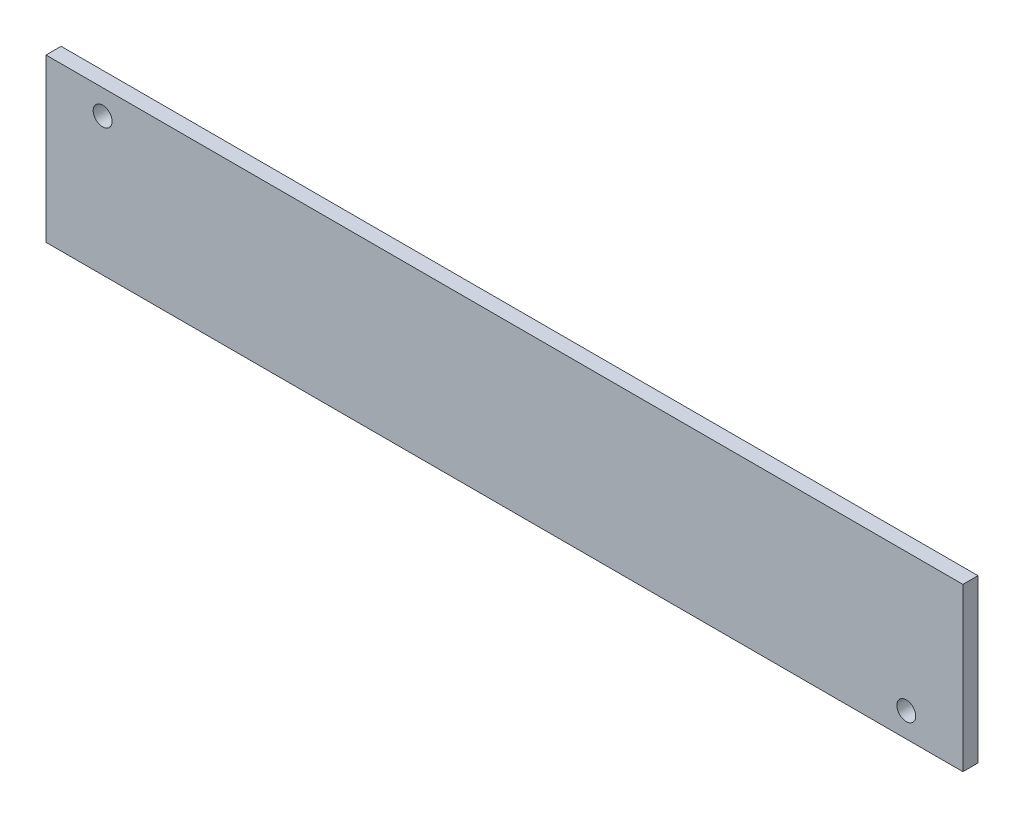
ISO-10303-21;
HEADER;
FILE_DESCRIPTION(('STEP AP214'),'2;1');
FILE_NAME('part.step','',(''),(''),'','','');
FILE_SCHEMA(('AUTOMOTIVE_DESIGN { 1 0 10303 214 1 1 1 1 }'));
ENDSEC;
DATA;
#1=APPLICATION_CONTEXT('core data for automotive mechanical design processes');
#2=APPLICATION_PROTOCOL_DEFINITION('international standard','automotive_design',2000,#1);
#3=PRODUCT_CONTEXT('',#1,'mechanical');
#4=PRODUCT('Part','Part','',(#3));
#5=PRODUCT_RELATED_PRODUCT_CATEGORY('part','',(#4));
#6=PRODUCT_DEFINITION_FORMATION('','',#4);
#7=PRODUCT_DEFINITION_CONTEXT('part definition',#1,'design');
#8=PRODUCT_DEFINITION('design','',#6,#7);
#9=PRODUCT_DEFINITION_SHAPE('','',#8);
#10=(LENGTH_UNIT() NAMED_UNIT(*) SI_UNIT(.MILLI.,.METRE.));
#11=(NAMED_UNIT(*) PLANE_ANGLE_UNIT() SI_UNIT($,.RADIAN.));
#12=(NAMED_UNIT(*) SI_UNIT($,.STERADIAN.) SOLID_ANGLE_UNIT());
#13=UNCERTAINTY_MEASURE_WITH_UNIT(LENGTH_MEASURE(1.E-05),#10,'distance_accuracy_value','');
#14=(GEOMETRIC_REPRESENTATION_CONTEXT(3) GLOBAL_UNCERTAINTY_ASSIGNED_CONTEXT((#13)) GLOBAL_UNIT_ASSIGNED_CONTEXT((#10,
#11,#12)) REPRESENTATION_CONTEXT('',''));
#15=CARTESIAN_POINT('',(0.,0.,0.));
#16=DIRECTION('',(0.,0.,1.));
#17=DIRECTION('',(1.,0.,0.));
#18=AXIS2_PLACEMENT_3D('',#15,#16,#17);
#19=CARTESIAN_POINT('',(-60.75,10.75,2.));
#20=DIRECTION('',(1.,0.,0.));
#21=DIRECTION('',(0.,0.,-1.));
#22=AXIS2_PLACEMENT_3D('',#19,#20,#21);
#23=PLANE('',#22);
#24=DIRECTION('',(0.,-1.,0.));
#25=VECTOR('',#24,1.);
#26=CARTESIAN_POINT('',(-60.75,10.75,0.));
#27=LINE('',#26,#25);
#28=CARTESIAN_POINT('',(-60.75,10.75,0.));
#29=VERTEX_POINT('',#28);
#30=CARTESIAN_POINT('',(-60.75,-10.75,0.));
#31=VERTEX_POINT('',#30);
#32=EDGE_CURVE('E102',#29,#31,#27,.T.);
#33=ORIENTED_EDGE('',*,*,#32,.T.);
#34=DIRECTION('',(0.,0.,-1.));
#35=VECTOR('',#34,1.);
#36=CARTESIAN_POINT('',(-60.75,-10.75,2.));
#37=LINE('',#36,#35);
#38=CARTESIAN_POINT('',(-60.75,-10.75,2.));
#39=VERTEX_POINT('',#38);
#40=EDGE_CURVE('E11',#39,#31,#37,.T.);
#41=ORIENTED_EDGE('',*,*,#40,.F.);
#42=DIRECTION('',(0.,-1.,0.));
#43=VECTOR('',#42,1.);
#44=CARTESIAN_POINT('',(-60.75,10.75,2.));
#45=LINE('',#44,#43);
#46=CARTESIAN_POINT('',(-60.75,10.75,2.));
#47=VERTEX_POINT('',#46);
#48=EDGE_CURVE('E90',#47,#39,#45,.T.);
#49=ORIENTED_EDGE('',*,*,#48,.F.);
#50=DIRECTION('',(0.,0.,-1.));
#51=VECTOR('',#50,1.);
#52=CARTESIAN_POINT('',(-60.75,10.75,2.));
#53=LINE('',#52,#51);
#54=EDGE_CURVE('E98',#47,#29,#53,.T.);
#55=ORIENTED_EDGE('',*,*,#54,.T.);
#56=EDGE_LOOP('',(#33,#41,#49,#55));
#57=FACE_BOUND('',#56,.T.);
#58=ADVANCED_FACE('F39',(#57),#23,.F.);
#59=CARTESIAN_POINT('',(-60.75,-10.75,2.));
#60=DIRECTION('',(0.,1.,0.));
#61=DIRECTION('',(0.,0.,1.));
#62=AXIS2_PLACEMENT_3D('',#59,#60,#61);
#63=PLANE('',#62);
#64=DIRECTION('',(1.,0.,0.));
#65=VECTOR('',#64,1.);
#66=CARTESIAN_POINT('',(-60.75,-10.75,0.));
#67=LINE('',#66,#65);
#68=CARTESIAN_POINT('',(60.75,-10.75,0.));
#69=VERTEX_POINT('',#68);
#70=EDGE_CURVE('E94',#31,#69,#67,.T.);
#71=ORIENTED_EDGE('',*,*,#70,.T.);
#72=DIRECTION('',(0.,0.,-1.));
#73=VECTOR('',#72,1.);
#74=CARTESIAN_POINT('',(60.75,-10.75,2.));
#75=LINE('',#74,#73);
#76=CARTESIAN_POINT('',(60.75,-10.75,2.));
#77=VERTEX_POINT('',#76);
#78=EDGE_CURVE('E47',#77,#69,#75,.T.);
#79=ORIENTED_EDGE('',*,*,#78,.F.);
#80=DIRECTION('',(1.,0.,0.));
#81=VECTOR('',#80,1.);
#82=CARTESIAN_POINT('',(-60.75,-10.75,2.));
#83=LINE('',#82,#81);
#84=EDGE_CURVE('E85',#39,#77,#83,.T.);
#85=ORIENTED_EDGE('',*,*,#84,.F.);
#86=ORIENTED_EDGE('',*,*,#40,.T.);
#87=EDGE_LOOP('',(#71,#79,#85,#86));
#88=FACE_BOUND('',#87,.T.);
#89=ADVANCED_FACE('F93',(#88),#63,.F.);
#90=CARTESIAN_POINT('',(60.75,10.75,2.));
#91=DIRECTION('',(-1.,0.,0.));
#92=DIRECTION('',(0.,-1.,0.));
#93=AXIS2_PLACEMENT_3D('',#90,#91,#92);
#94=PLANE('',#93);
#95=DIRECTION('',(0.,1.,0.));
#96=VECTOR('',#95,1.);
#97=CARTESIAN_POINT('',(60.75,10.75,0.));
#98=LINE('',#97,#96);
#99=CARTESIAN_POINT('',(60.75,10.75,0.));
#100=VERTEX_POINT('',#99);
#101=EDGE_CURVE('E72',#69,#100,#98,.T.);
#102=ORIENTED_EDGE('',*,*,#101,.T.);
#103=DIRECTION('',(0.,0.,-1.));
#104=VECTOR('',#103,1.);
#105=CARTESIAN_POINT('',(60.75,10.75,2.));
#106=LINE('',#105,#104);
#107=CARTESIAN_POINT('',(60.75,10.75,2.));
#108=VERTEX_POINT('',#107);
#109=EDGE_CURVE('E95',#108,#100,#106,.T.);
#110=ORIENTED_EDGE('',*,*,#109,.F.);
#111=DIRECTION('',(0.,1.,0.));
#112=VECTOR('',#111,1.);
#113=CARTESIAN_POINT('',(60.75,10.75,2.));
#114=LINE('',#113,#112);
#115=EDGE_CURVE('E88',#77,#108,#114,.T.);
#116=ORIENTED_EDGE('',*,*,#115,.F.);
#117=ORIENTED_EDGE('',*,*,#78,.T.);
#118=EDGE_LOOP('',(#102,#110,#116,#117));
#119=FACE_BOUND('',#118,.T.);
#120=ADVANCED_FACE('F96',(#119),#94,.F.);
#121=CARTESIAN_POINT('',(-60.75,10.75,2.));
#122=DIRECTION('',(0.,-1.,0.));
#123=DIRECTION('',(0.,0.,-1.));
#124=AXIS2_PLACEMENT_3D('',#121,#122,#123);
#125=PLANE('',#124);
#126=DIRECTION('',(-1.,0.,0.));
#127=VECTOR('',#126,1.);
#128=CARTESIAN_POINT('',(-60.75,10.75,0.));
#129=LINE('',#128,#127);
#130=EDGE_CURVE('E78',#100,#29,#129,.T.);
#131=ORIENTED_EDGE('',*,*,#130,.T.);
#132=ORIENTED_EDGE('',*,*,#54,.F.);
#133=DIRECTION('',(-1.,0.,0.));
#134=VECTOR('',#133,1.);
#135=CARTESIAN_POINT('',(-60.75,10.75,2.));
#136=LINE('',#135,#134);
#137=EDGE_CURVE('E55',#108,#47,#136,.T.);
#138=ORIENTED_EDGE('',*,*,#137,.F.);
#139=ORIENTED_EDGE('',*,*,#109,.T.);
#140=EDGE_LOOP('',(#131,#132,#138,#139));
#141=FACE_BOUND('',#140,.T.);
#142=ADVANCED_FACE('F110',(#141),#125,.F.);
#143=CARTESIAN_POINT('',(0.,0.,2.));
#144=DIRECTION('',(0.,0.,1.));
#145=DIRECTION('',(1.,0.,0.));
#146=AXIS2_PLACEMENT_3D('',#143,#144,#145);
#147=PLANE('',#146);
#148=CARTESIAN_POINT('',(-53.25,7.5,2.));
#149=DIRECTION('',(0.,0.,1.));
#150=DIRECTION('',(1.,0.,0.));
#151=AXIS2_PLACEMENT_3D('',#148,#149,#150);
#152=CIRCLE('',#151,1.25);
#153=CARTESIAN_POINT('',(-52.,7.5,2.));
#154=VERTEX_POINT('',#153);
#155=EDGE_CURVE('E122',#154,#154,#152,.T.);
#156=ORIENTED_EDGE('',*,*,#155,.F.);
#157=EDGE_LOOP('',(#156));
#158=FACE_BOUND('',#157,.T.);
#159=CARTESIAN_POINT('',(53.25,-7.5,2.));
#160=DIRECTION('',(0.,0.,1.));
#161=DIRECTION('',(1.,0.,0.));
#162=AXIS2_PLACEMENT_3D('',#159,#160,#161);
#163=CIRCLE('',#162,1.25);
#164=CARTESIAN_POINT('',(54.5,-7.5,2.));
#165=VERTEX_POINT('',#164);
#166=EDGE_CURVE('E119',#165,#165,#163,.T.);
#167=ORIENTED_EDGE('',*,*,#166,.F.);
#168=EDGE_LOOP('',(#167));
#169=FACE_BOUND('',#168,.T.);
#170=ORIENTED_EDGE('',*,*,#48,.T.);
#171=ORIENTED_EDGE('',*,*,#84,.T.);
#172=ORIENTED_EDGE('',*,*,#115,.T.);
#173=ORIENTED_EDGE('',*,*,#137,.T.);
#174=EDGE_LOOP('',(#170,#171,#172,#173));
#175=FACE_BOUND('',#174,.T.);
#176=ADVANCED_FACE('F86',(#158,#169,#175),#147,.T.);
#177=CARTESIAN_POINT('',(0.,0.,0.));
#178=DIRECTION('',(0.,0.,1.));
#179=DIRECTION('',(1.,0.,0.));
#180=AXIS2_PLACEMENT_3D('',#177,#178,#179);
#181=PLANE('',#180);
#182=CARTESIAN_POINT('',(-53.25,7.5,0.));
#183=DIRECTION('',(0.,0.,1.));
#184=DIRECTION('',(1.,0.,0.));
#185=AXIS2_PLACEMENT_3D('',#182,#183,#184);
#186=CIRCLE('',#185,1.25);
#187=CARTESIAN_POINT('',(-52.,7.5,0.));
#188=VERTEX_POINT('',#187);
#189=EDGE_CURVE('E105',#188,#188,#186,.T.);
#190=ORIENTED_EDGE('',*,*,#189,.T.);
#191=EDGE_LOOP('',(#190));
#192=FACE_BOUND('',#191,.T.);
#193=CARTESIAN_POINT('',(53.25,-7.5,0.));
#194=DIRECTION('',(0.,0.,1.));
#195=DIRECTION('',(1.,0.,0.));
#196=AXIS2_PLACEMENT_3D('',#193,#194,#195);
#197=CIRCLE('',#196,1.25);
#198=CARTESIAN_POINT('',(54.5,-7.5,0.));
#199=VERTEX_POINT('',#198);
#200=EDGE_CURVE('E116',#199,#199,#197,.T.);
#201=ORIENTED_EDGE('',*,*,#200,.T.);
#202=EDGE_LOOP('',(#201));
#203=FACE_BOUND('',#202,.T.);
#204=ORIENTED_EDGE('',*,*,#32,.F.);
#205=ORIENTED_EDGE('',*,*,#130,.F.);
#206=ORIENTED_EDGE('',*,*,#101,.F.);
#207=ORIENTED_EDGE('',*,*,#70,.F.);
#208=EDGE_LOOP('',(#204,#205,#206,#207));
#209=FACE_BOUND('',#208,.T.);
#210=ADVANCED_FACE('F113',(#192,#203,#209),#181,.F.);
#211=CARTESIAN_POINT('',(53.25,-7.5,0.));
#212=DIRECTION('',(0.,0.,1.));
#213=DIRECTION('',(1.,0.,0.));
#214=AXIS2_PLACEMENT_3D('',#211,#212,#213);
#215=CYLINDRICAL_SURFACE('',#214,1.25);
#216=ORIENTED_EDGE('',*,*,#200,.F.);
#217=EDGE_LOOP('',(#216));
#218=FACE_BOUND('',#217,.T.);
#219=ORIENTED_EDGE('',*,*,#166,.T.);
#220=EDGE_LOOP('',(#219));
#221=FACE_BOUND('',#220,.T.);
#222=ADVANCED_FACE('F133',(#218,#221),#215,.F.);
#223=CARTESIAN_POINT('',(-53.25,7.5,0.));
#224=DIRECTION('',(0.,0.,1.));
#225=DIRECTION('',(1.,0.,0.));
#226=AXIS2_PLACEMENT_3D('',#223,#224,#225);
#227=CYLINDRICAL_SURFACE('',#226,1.25);
#228=ORIENTED_EDGE('',*,*,#189,.F.);
#229=EDGE_LOOP('',(#228));
#230=FACE_BOUND('',#229,.T.);
#231=ORIENTED_EDGE('',*,*,#155,.T.);
#232=EDGE_LOOP('',(#231));
#233=FACE_BOUND('',#232,.T.);
#234=ADVANCED_FACE('F130',(#230,#233),#227,.F.);
#235=CLOSED_SHELL('',(#58,#89,#120,#142,#176,#210,#222,#234));
#236=MANIFOLD_SOLID_BREP('B2',#235);
#237=ADVANCED_BREP_SHAPE_REPRESENTATION('',(#18,#236),#14);
#238=SHAPE_DEFINITION_REPRESENTATION(#9,#237);
ENDSEC;
END-ISO-10303-21;
